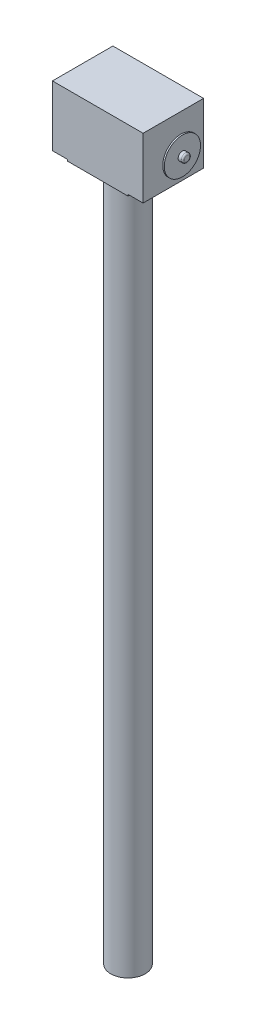
ISO-10303-21;
HEADER;
FILE_DESCRIPTION(('STEP AP214'),'2;1');
FILE_NAME('part.step','',(''),(''),'','','');
FILE_SCHEMA(('AUTOMOTIVE_DESIGN { 1 0 10303 214 1 1 1 1 }'));
ENDSEC;
DATA;
#1=APPLICATION_CONTEXT('core data for automotive mechanical design processes');
#2=APPLICATION_PROTOCOL_DEFINITION('international standard','automotive_design',2000,#1);
#3=PRODUCT_CONTEXT('',#1,'mechanical');
#4=PRODUCT('Part','Part','',(#3));
#5=PRODUCT_RELATED_PRODUCT_CATEGORY('part','',(#4));
#6=PRODUCT_DEFINITION_FORMATION('','',#4);
#7=PRODUCT_DEFINITION_CONTEXT('part definition',#1,'design');
#8=PRODUCT_DEFINITION('design','',#6,#7);
#9=PRODUCT_DEFINITION_SHAPE('','',#8);
#10=(LENGTH_UNIT() NAMED_UNIT(*) SI_UNIT(.MILLI.,.METRE.));
#11=(NAMED_UNIT(*) PLANE_ANGLE_UNIT() SI_UNIT($,.RADIAN.));
#12=(NAMED_UNIT(*) SI_UNIT($,.STERADIAN.) SOLID_ANGLE_UNIT());
#13=UNCERTAINTY_MEASURE_WITH_UNIT(LENGTH_MEASURE(1.E-05),#10,'distance_accuracy_value','');
#14=(GEOMETRIC_REPRESENTATION_CONTEXT(3) GLOBAL_UNCERTAINTY_ASSIGNED_CONTEXT((#13)) GLOBAL_UNIT_ASSIGNED_CONTEXT((#10,
#11,#12)) REPRESENTATION_CONTEXT('',''));
#15=CARTESIAN_POINT('',(0.,0.,0.));
#16=DIRECTION('',(0.,0.,1.));
#17=DIRECTION('',(1.,0.,0.));
#18=AXIS2_PLACEMENT_3D('',#15,#16,#17);
#19=CARTESIAN_POINT('',(0.,-5.,0.));
#20=DIRECTION('',(0.,-1.,0.));
#21=DIRECTION('',(0.,0.,-1.));
#22=AXIS2_PLACEMENT_3D('',#19,#20,#21);
#23=PLANE('',#22);
#24=DIRECTION('',(0.,0.,-1.));
#25=VECTOR('',#24,1.);
#26=CARTESIAN_POINT('',(-100.,-5.,100.));
#27=LINE('',#26,#25);
#28=CARTESIAN_POINT('',(-100.,-5.,100.));
#29=VERTEX_POINT('',#28);
#30=CARTESIAN_POINT('',(-100.,-5.,-100.));
#31=VERTEX_POINT('',#30);
#32=EDGE_CURVE('E110',#29,#31,#27,.T.);
#33=ORIENTED_EDGE('',*,*,#32,.T.);
#34=DIRECTION('',(1.,0.,0.));
#35=VECTOR('',#34,1.);
#36=CARTESIAN_POINT('',(-100.,-5.,-100.));
#37=LINE('',#36,#35);
#38=CARTESIAN_POINT('',(100.,-5.,-100.));
#39=VERTEX_POINT('',#38);
#40=EDGE_CURVE('E99',#31,#39,#37,.T.);
#41=ORIENTED_EDGE('',*,*,#40,.T.);
#42=DIRECTION('',(0.,0.,1.));
#43=VECTOR('',#42,1.);
#44=CARTESIAN_POINT('',(100.,-5.,100.));
#45=LINE('',#44,#43);
#46=CARTESIAN_POINT('',(100.,-5.,100.));
#47=VERTEX_POINT('',#46);
#48=EDGE_CURVE('E109',#39,#47,#45,.T.);
#49=ORIENTED_EDGE('',*,*,#48,.T.);
#50=DIRECTION('',(-1.,0.,0.));
#51=VECTOR('',#50,1.);
#52=CARTESIAN_POINT('',(-100.,-5.,100.));
#53=LINE('',#52,#51);
#54=EDGE_CURVE('E115',#47,#29,#53,.T.);
#55=ORIENTED_EDGE('',*,*,#54,.T.);
#56=EDGE_LOOP('',(#33,#41,#49,#55));
#57=FACE_BOUND('',#56,.T.);
#58=CARTESIAN_POINT('',(0.,-5.,0.));
#59=DIRECTION('',(0.,-1.,0.));
#60=DIRECTION('',(0.,0.,-1.));
#61=AXIS2_PLACEMENT_3D('',#58,#59,#60);
#62=CIRCLE('',#61,57.);
#63=CARTESIAN_POINT('',(0.,-5.,-57.));
#64=VERTEX_POINT('',#63);
#65=EDGE_CURVE('E156',#64,#64,#62,.T.);
#66=ORIENTED_EDGE('',*,*,#65,.F.);
#67=EDGE_LOOP('',(#66));
#68=FACE_BOUND('',#67,.T.);
#69=ADVANCED_FACE('F34',(#57,#68),#23,.T.);
#70=CARTESIAN_POINT('',(0.,0.,0.));
#71=DIRECTION('',(0.,1.,0.));
#72=DIRECTION('',(0.,0.,1.));
#73=AXIS2_PLACEMENT_3D('',#70,#71,#72);
#74=PLANE('',#73);
#75=DIRECTION('',(0.,0.,-1.));
#76=VECTOR('',#75,1.);
#77=CARTESIAN_POINT('',(-100.,0.,100.));
#78=LINE('',#77,#76);
#79=CARTESIAN_POINT('',(-100.,0.,100.));
#80=VERTEX_POINT('',#79);
#81=CARTESIAN_POINT('',(-100.,0.,-100.));
#82=VERTEX_POINT('',#81);
#83=EDGE_CURVE('E51',#80,#82,#78,.T.);
#84=ORIENTED_EDGE('',*,*,#83,.F.);
#85=DIRECTION('',(1.,0.,0.));
#86=VECTOR('',#85,1.);
#87=CARTESIAN_POINT('',(-150.,0.,100.));
#88=LINE('',#87,#86);
#89=CARTESIAN_POINT('',(-150.,0.,100.));
#90=VERTEX_POINT('',#89);
#91=EDGE_CURVE('E237',#90,#80,#88,.T.);
#92=ORIENTED_EDGE('',*,*,#91,.F.);
#93=DIRECTION('',(0.,0.,1.));
#94=VECTOR('',#93,1.);
#95=CARTESIAN_POINT('',(-150.,0.,-100.));
#96=LINE('',#95,#94);
#97=CARTESIAN_POINT('',(-150.,0.,-100.));
#98=VERTEX_POINT('',#97);
#99=EDGE_CURVE('E229',#98,#90,#96,.T.);
#100=ORIENTED_EDGE('',*,*,#99,.F.);
#101=DIRECTION('',(-1.,0.,0.));
#102=VECTOR('',#101,1.);
#103=CARTESIAN_POINT('',(-150.,0.,-100.));
#104=LINE('',#103,#102);
#105=EDGE_CURVE('E56',#82,#98,#104,.T.);
#106=ORIENTED_EDGE('',*,*,#105,.F.);
#107=EDGE_LOOP('',(#84,#92,#100,#106));
#108=FACE_BOUND('',#107,.T.);
#109=ADVANCED_FACE('F171',(#108),#74,.F.);
#110=DIRECTION('',(0.,0.,1.));
#111=VECTOR('',#110,1.);
#112=CARTESIAN_POINT('',(100.,0.,100.));
#113=LINE('',#112,#111);
#114=CARTESIAN_POINT('',(100.,0.,-100.));
#115=VERTEX_POINT('',#114);
#116=CARTESIAN_POINT('',(100.,0.,100.));
#117=VERTEX_POINT('',#116);
#118=EDGE_CURVE('E119',#115,#117,#113,.T.);
#119=ORIENTED_EDGE('',*,*,#118,.F.);
#120=CARTESIAN_POINT('',(150.,0.,-100.));
#121=VERTEX_POINT('',#120);
#122=EDGE_CURVE('E251',#121,#115,#104,.T.);
#123=ORIENTED_EDGE('',*,*,#122,.F.);
#124=DIRECTION('',(0.,0.,-1.));
#125=VECTOR('',#124,1.);
#126=CARTESIAN_POINT('',(150.,0.,-100.));
#127=LINE('',#126,#125);
#128=CARTESIAN_POINT('',(150.,0.,100.));
#129=VERTEX_POINT('',#128);
#130=EDGE_CURVE('E246',#129,#121,#127,.T.);
#131=ORIENTED_EDGE('',*,*,#130,.F.);
#132=EDGE_CURVE('E147',#117,#129,#88,.T.);
#133=ORIENTED_EDGE('',*,*,#132,.F.);
#134=EDGE_LOOP('',(#119,#123,#131,#133));
#135=FACE_BOUND('',#134,.T.);
#136=ADVANCED_FACE('F176',(#135),#74,.F.);
#137=CARTESIAN_POINT('',(190.,100.,0.));
#138=DIRECTION('',(1.,0.,0.));
#139=DIRECTION('',(0.,0.,-1.));
#140=AXIS2_PLACEMENT_3D('',#137,#138,#139);
#141=TOROIDAL_SURFACE('',#140,9.,5.);
#142=CARTESIAN_POINT('',(195.,100.,0.));
#143=DIRECTION('',(1.,0.,0.));
#144=DIRECTION('',(0.,0.,-1.));
#145=AXIS2_PLACEMENT_3D('',#142,#143,#144);
#146=CIRCLE('',#145,9.);
#147=CARTESIAN_POINT('',(195.,100.,-9.00000000000002));
#148=VERTEX_POINT('',#147);
#149=EDGE_CURVE('E43',#148,#148,#146,.T.);
#150=ORIENTED_EDGE('',*,*,#149,.F.);
#151=EDGE_LOOP('',(#150));
#152=FACE_BOUND('',#151,.T.);
#153=CARTESIAN_POINT('',(190.,100.,0.));
#154=DIRECTION('',(1.,0.,0.));
#155=DIRECTION('',(0.,0.,-1.));
#156=AXIS2_PLACEMENT_3D('',#153,#154,#155);
#157=CIRCLE('',#156,14.);
#158=CARTESIAN_POINT('',(190.,100.,-14.));
#159=VERTEX_POINT('',#158);
#160=EDGE_CURVE('E11',#159,#159,#157,.F.);
#161=ORIENTED_EDGE('',*,*,#160,.F.);
#162=EDGE_LOOP('',(#161));
#163=FACE_BOUND('',#162,.T.);
#164=ADVANCED_FACE('F36',(#152,#163),#141,.T.);
#165=CARTESIAN_POINT('',(180.,100.,0.));
#166=DIRECTION('',(1.,0.,0.));
#167=DIRECTION('',(0.,0.,-1.));
#168=AXIS2_PLACEMENT_3D('',#165,#166,#167);
#169=PLANE('',#168);
#170=CARTESIAN_POINT('',(180.,100.,0.));
#171=DIRECTION('',(1.,0.,0.));
#172=DIRECTION('',(0.,0.,-1.));
#173=AXIS2_PLACEMENT_3D('',#170,#171,#172);
#174=CIRCLE('',#173,60.);
#175=CARTESIAN_POINT('',(180.,100.,-60.));
#176=VERTEX_POINT('',#175);
#177=EDGE_CURVE('E239',#176,#176,#174,.T.);
#178=ORIENTED_EDGE('',*,*,#177,.T.);
#179=EDGE_LOOP('',(#178));
#180=FACE_BOUND('',#179,.T.);
#181=CARTESIAN_POINT('',(180.,100.,0.));
#182=DIRECTION('',(1.,0.,0.));
#183=DIRECTION('',(0.,0.,-1.));
#184=AXIS2_PLACEMENT_3D('',#181,#182,#183);
#185=CIRCLE('',#184,14.);
#186=CARTESIAN_POINT('',(180.,100.,-14.));
#187=VERTEX_POINT('',#186);
#188=EDGE_CURVE('E122',#187,#187,#185,.T.);
#189=ORIENTED_EDGE('',*,*,#188,.F.);
#190=EDGE_LOOP('',(#189));
#191=FACE_BOUND('',#190,.T.);
#192=ADVANCED_FACE('F194',(#180,#191),#169,.T.);
#193=CARTESIAN_POINT('',(150.,200.,-100.));
#194=DIRECTION('',(-1.,0.,0.));
#195=DIRECTION('',(0.,0.,1.));
#196=AXIS2_PLACEMENT_3D('',#193,#194,#195);
#197=PLANE('',#196);
#198=ORIENTED_EDGE('',*,*,#130,.T.);
#199=DIRECTION('',(0.,-1.,0.));
#200=VECTOR('',#199,1.);
#201=CARTESIAN_POINT('',(150.,200.,-100.));
#202=LINE('',#201,#200);
#203=CARTESIAN_POINT('',(150.,200.,-100.));
#204=VERTEX_POINT('',#203);
#205=EDGE_CURVE('E256',#204,#121,#202,.T.);
#206=ORIENTED_EDGE('',*,*,#205,.F.);
#207=DIRECTION('',(0.,0.,-1.));
#208=VECTOR('',#207,1.);
#209=CARTESIAN_POINT('',(150.,200.,-100.));
#210=LINE('',#209,#208);
#211=CARTESIAN_POINT('',(150.,200.,100.));
#212=VERTEX_POINT('',#211);
#213=EDGE_CURVE('E290',#212,#204,#210,.T.);
#214=ORIENTED_EDGE('',*,*,#213,.F.);
#215=DIRECTION('',(0.,-1.,0.));
#216=VECTOR('',#215,1.);
#217=CARTESIAN_POINT('',(150.,200.,100.));
#218=LINE('',#217,#216);
#219=EDGE_CURVE('E259',#212,#129,#218,.T.);
#220=ORIENTED_EDGE('',*,*,#219,.T.);
#221=EDGE_LOOP('',(#198,#206,#214,#220));
#222=FACE_BOUND('',#221,.T.);
#223=CARTESIAN_POINT('',(150.,100.,0.));
#224=DIRECTION('',(-1.,0.,0.));
#225=DIRECTION('',(0.,0.,1.));
#226=AXIS2_PLACEMENT_3D('',#223,#224,#225);
#227=CIRCLE('',#226,14.);
#228=CARTESIAN_POINT('',(150.,100.,14.));
#229=VERTEX_POINT('',#228);
#230=EDGE_CURVE('E263',#229,#229,#227,.F.);
#231=ORIENTED_EDGE('',*,*,#230,.F.);
#232=EDGE_LOOP('',(#231));
#233=FACE_BOUND('',#232,.T.);
#234=ADVANCED_FACE('F197',(#222,#233),#197,.F.);
#235=CARTESIAN_POINT('',(-150.,200.,-100.));
#236=DIRECTION('',(1.,0.,0.));
#237=DIRECTION('',(0.,0.,-1.));
#238=AXIS2_PLACEMENT_3D('',#235,#236,#237);
#239=PLANE('',#238);
#240=ORIENTED_EDGE('',*,*,#99,.T.);
#241=DIRECTION('',(0.,-1.,0.));
#242=VECTOR('',#241,1.);
#243=CARTESIAN_POINT('',(-150.,200.,100.));
#244=LINE('',#243,#242);
#245=CARTESIAN_POINT('',(-150.,200.,100.));
#246=VERTEX_POINT('',#245);
#247=EDGE_CURVE('E232',#246,#90,#244,.T.);
#248=ORIENTED_EDGE('',*,*,#247,.F.);
#249=DIRECTION('',(0.,0.,1.));
#250=VECTOR('',#249,1.);
#251=CARTESIAN_POINT('',(-150.,200.,-100.));
#252=LINE('',#251,#250);
#253=CARTESIAN_POINT('',(-150.,200.,-100.));
#254=VERTEX_POINT('',#253);
#255=EDGE_CURVE('E285',#254,#246,#252,.T.);
#256=ORIENTED_EDGE('',*,*,#255,.F.);
#257=DIRECTION('',(0.,-1.,0.));
#258=VECTOR('',#257,1.);
#259=CARTESIAN_POINT('',(-150.,200.,-100.));
#260=LINE('',#259,#258);
#261=EDGE_CURVE('E234',#254,#98,#260,.T.);
#262=ORIENTED_EDGE('',*,*,#261,.T.);
#263=EDGE_LOOP('',(#240,#248,#256,#262));
#264=FACE_BOUND('',#263,.T.);
#265=ADVANCED_FACE('F219',(#264),#239,.F.);
#266=CARTESIAN_POINT('',(-150.,200.,100.));
#267=DIRECTION('',(0.,0.,-1.));
#268=DIRECTION('',(-1.,0.,0.));
#269=AXIS2_PLACEMENT_3D('',#266,#267,#268);
#270=PLANE('',#269);
#271=ORIENTED_EDGE('',*,*,#91,.T.);
#272=DIRECTION('',(0.,1.,0.));
#273=VECTOR('',#272,1.);
#274=CARTESIAN_POINT('',(-100.,-5.,100.));
#275=LINE('',#274,#273);
#276=EDGE_CURVE('E136',#29,#80,#275,.T.);
#277=ORIENTED_EDGE('',*,*,#276,.F.);
#278=ORIENTED_EDGE('',*,*,#54,.F.);
#279=DIRECTION('',(0.,1.,0.));
#280=VECTOR('',#279,1.);
#281=CARTESIAN_POINT('',(100.,-5.,100.));
#282=LINE('',#281,#280);
#283=EDGE_CURVE('E127',#47,#117,#282,.T.);
#284=ORIENTED_EDGE('',*,*,#283,.T.);
#285=ORIENTED_EDGE('',*,*,#132,.T.);
#286=ORIENTED_EDGE('',*,*,#219,.F.);
#287=DIRECTION('',(1.,0.,0.));
#288=VECTOR('',#287,1.);
#289=CARTESIAN_POINT('',(-150.,200.,100.));
#290=LINE('',#289,#288);
#291=EDGE_CURVE('E287',#246,#212,#290,.T.);
#292=ORIENTED_EDGE('',*,*,#291,.F.);
#293=ORIENTED_EDGE('',*,*,#247,.T.);
#294=EDGE_LOOP('',(#271,#277,#278,#284,#285,#286,#292,#293));
#295=FACE_BOUND('',#294,.T.);
#296=ADVANCED_FACE('F216',(#295),#270,.F.);
#297=CARTESIAN_POINT('',(-150.,200.,-100.));
#298=DIRECTION('',(0.,0.,1.));
#299=DIRECTION('',(1.,0.,0.));
#300=AXIS2_PLACEMENT_3D('',#297,#298,#299);
#301=PLANE('',#300);
#302=ORIENTED_EDGE('',*,*,#122,.T.);
#303=DIRECTION('',(0.,1.,0.));
#304=VECTOR('',#303,1.);
#305=CARTESIAN_POINT('',(100.,-5.,-100.));
#306=LINE('',#305,#304);
#307=EDGE_CURVE('E106',#39,#115,#306,.T.);
#308=ORIENTED_EDGE('',*,*,#307,.F.);
#309=ORIENTED_EDGE('',*,*,#40,.F.);
#310=DIRECTION('',(0.,1.,0.));
#311=VECTOR('',#310,1.);
#312=CARTESIAN_POINT('',(-100.,-5.,-100.));
#313=LINE('',#312,#311);
#314=EDGE_CURVE('E104',#31,#82,#313,.T.);
#315=ORIENTED_EDGE('',*,*,#314,.T.);
#316=ORIENTED_EDGE('',*,*,#105,.T.);
#317=ORIENTED_EDGE('',*,*,#261,.F.);
#318=DIRECTION('',(-1.,0.,0.));
#319=VECTOR('',#318,1.);
#320=CARTESIAN_POINT('',(-150.,200.,-100.));
#321=LINE('',#320,#319);
#322=EDGE_CURVE('E242',#204,#254,#321,.T.);
#323=ORIENTED_EDGE('',*,*,#322,.F.);
#324=ORIENTED_EDGE('',*,*,#205,.T.);
#325=EDGE_LOOP('',(#302,#308,#309,#315,#316,#317,#323,#324));
#326=FACE_BOUND('',#325,.T.);
#327=ADVANCED_FACE('F102',(#326),#301,.F.);
#328=CARTESIAN_POINT('',(0.,200.,0.));
#329=DIRECTION('',(0.,1.,0.));
#330=DIRECTION('',(0.,0.,1.));
#331=AXIS2_PLACEMENT_3D('',#328,#329,#330);
#332=PLANE('',#331);
#333=ORIENTED_EDGE('',*,*,#255,.T.);
#334=ORIENTED_EDGE('',*,*,#291,.T.);
#335=ORIENTED_EDGE('',*,*,#213,.T.);
#336=ORIENTED_EDGE('',*,*,#322,.T.);
#337=EDGE_LOOP('',(#333,#334,#335,#336));
#338=FACE_BOUND('',#337,.T.);
#339=ADVANCED_FACE('F209',(#338),#332,.T.);
#340=CARTESIAN_POINT('',(175.,100.,0.));
#341=DIRECTION('',(-1.,0.,0.));
#342=DIRECTION('',(0.,0.,1.));
#343=AXIS2_PLACEMENT_3D('',#340,#341,#342);
#344=CYLINDRICAL_SURFACE('',#343,14.);
#345=CARTESIAN_POINT('',(175.,100.,0.));
#346=DIRECTION('',(1.,0.,0.));
#347=DIRECTION('',(0.,0.,-1.));
#348=AXIS2_PLACEMENT_3D('',#345,#346,#347);
#349=CIRCLE('',#348,14.);
#350=CARTESIAN_POINT('',(175.,100.,-14.));
#351=VERTEX_POINT('',#350);
#352=EDGE_CURVE('E235',#351,#351,#349,.T.);
#353=ORIENTED_EDGE('',*,*,#352,.F.);
#354=EDGE_LOOP('',(#353));
#355=FACE_BOUND('',#354,.T.);
#356=ORIENTED_EDGE('',*,*,#230,.T.);
#357=EDGE_LOOP('',(#356));
#358=FACE_BOUND('',#357,.T.);
#359=ADVANCED_FACE('F202',(#355,#358),#344,.T.);
#360=CARTESIAN_POINT('',(175.,100.,0.));
#361=DIRECTION('',(1.,0.,0.));
#362=DIRECTION('',(0.,0.,-1.));
#363=AXIS2_PLACEMENT_3D('',#360,#361,#362);
#364=PLANE('',#363);
#365=CARTESIAN_POINT('',(175.,100.,0.));
#366=DIRECTION('',(1.,0.,0.));
#367=DIRECTION('',(0.,0.,-1.));
#368=AXIS2_PLACEMENT_3D('',#365,#366,#367);
#369=CIRCLE('',#368,60.);
#370=CARTESIAN_POINT('',(175.,100.,-60.));
#371=VERTEX_POINT('',#370);
#372=EDGE_CURVE('E125',#371,#371,#369,.T.);
#373=ORIENTED_EDGE('',*,*,#372,.F.);
#374=EDGE_LOOP('',(#373));
#375=FACE_BOUND('',#374,.T.);
#376=ORIENTED_EDGE('',*,*,#352,.T.);
#377=EDGE_LOOP('',(#376));
#378=FACE_BOUND('',#377,.T.);
#379=ADVANCED_FACE('F199',(#375,#378),#364,.F.);
#380=CARTESIAN_POINT('',(180.,100.,0.));
#381=DIRECTION('',(-1.,0.,0.));
#382=DIRECTION('',(0.,0.,1.));
#383=AXIS2_PLACEMENT_3D('',#380,#381,#382);
#384=CYLINDRICAL_SURFACE('',#383,60.);
#385=ORIENTED_EDGE('',*,*,#177,.F.);
#386=EDGE_LOOP('',(#385));
#387=FACE_BOUND('',#386,.T.);
#388=ORIENTED_EDGE('',*,*,#372,.T.);
#389=EDGE_LOOP('',(#388));
#390=FACE_BOUND('',#389,.T.);
#391=ADVANCED_FACE('F192',(#387,#390),#384,.T.);
#392=CARTESIAN_POINT('',(195.,100.,0.));
#393=DIRECTION('',(-1.,0.,0.));
#394=DIRECTION('',(0.,0.,1.));
#395=AXIS2_PLACEMENT_3D('',#392,#393,#394);
#396=CYLINDRICAL_SURFACE('',#395,14.);
#397=ORIENTED_EDGE('',*,*,#160,.T.);
#398=EDGE_LOOP('',(#397));
#399=FACE_BOUND('',#398,.T.);
#400=ORIENTED_EDGE('',*,*,#188,.T.);
#401=EDGE_LOOP('',(#400));
#402=FACE_BOUND('',#401,.T.);
#403=ADVANCED_FACE('F188',(#399,#402),#396,.T.);
#404=CARTESIAN_POINT('',(195.,100.,0.));
#405=DIRECTION('',(1.,0.,0.));
#406=DIRECTION('',(0.,0.,-1.));
#407=AXIS2_PLACEMENT_3D('',#404,#405,#406);
#408=PLANE('',#407);
#409=ORIENTED_EDGE('',*,*,#149,.T.);
#410=EDGE_LOOP('',(#409));
#411=FACE_BOUND('',#410,.T.);
#412=ADVANCED_FACE('F185',(#411),#408,.T.);
#413=CARTESIAN_POINT('',(-100.,-5.,100.));
#414=DIRECTION('',(1.,0.,0.));
#415=DIRECTION('',(0.,0.,-1.));
#416=AXIS2_PLACEMENT_3D('',#413,#414,#415);
#417=PLANE('',#416);
#418=ORIENTED_EDGE('',*,*,#83,.T.);
#419=ORIENTED_EDGE('',*,*,#314,.F.);
#420=ORIENTED_EDGE('',*,*,#32,.F.);
#421=ORIENTED_EDGE('',*,*,#276,.T.);
#422=EDGE_LOOP('',(#418,#419,#420,#421));
#423=FACE_BOUND('',#422,.T.);
#424=ADVANCED_FACE('F121',(#423),#417,.F.);
#425=CARTESIAN_POINT('',(100.,-5.,100.));
#426=DIRECTION('',(-1.,0.,0.));
#427=DIRECTION('',(0.,0.,1.));
#428=AXIS2_PLACEMENT_3D('',#425,#426,#427);
#429=PLANE('',#428);
#430=ORIENTED_EDGE('',*,*,#118,.T.);
#431=ORIENTED_EDGE('',*,*,#283,.F.);
#432=ORIENTED_EDGE('',*,*,#48,.F.);
#433=ORIENTED_EDGE('',*,*,#307,.T.);
#434=EDGE_LOOP('',(#430,#431,#432,#433));
#435=FACE_BOUND('',#434,.T.);
#436=ADVANCED_FACE('F167',(#435),#429,.F.);
#437=CARTESIAN_POINT('',(0.,-2305.,0.));
#438=DIRECTION('',(0.,1.,0.));
#439=DIRECTION('',(0.,0.,1.));
#440=AXIS2_PLACEMENT_3D('',#437,#438,#439);
#441=CYLINDRICAL_SURFACE('',#440,57.);
#442=CARTESIAN_POINT('',(0.,-2305.,0.));
#443=DIRECTION('',(0.,-1.,0.));
#444=DIRECTION('',(0.,0.,-1.));
#445=AXIS2_PLACEMENT_3D('',#442,#443,#444);
#446=CIRCLE('',#445,57.);
#447=CARTESIAN_POINT('',(0.,-2305.,-57.));
#448=VERTEX_POINT('',#447);
#449=EDGE_CURVE('E135',#448,#448,#446,.T.);
#450=ORIENTED_EDGE('',*,*,#449,.F.);
#451=EDGE_LOOP('',(#450));
#452=FACE_BOUND('',#451,.T.);
#453=ORIENTED_EDGE('',*,*,#65,.T.);
#454=EDGE_LOOP('',(#453));
#455=FACE_BOUND('',#454,.T.);
#456=ADVANCED_FACE('F164',(#452,#455),#441,.T.);
#457=CARTESIAN_POINT('',(0.,-2305.,0.));
#458=DIRECTION('',(0.,-1.,0.));
#459=DIRECTION('',(0.,0.,-1.));
#460=AXIS2_PLACEMENT_3D('',#457,#458,#459);
#461=PLANE('',#460);
#462=ORIENTED_EDGE('',*,*,#449,.T.);
#463=EDGE_LOOP('',(#462));
#464=FACE_BOUND('',#463,.T.);
#465=ADVANCED_FACE('F162',(#464),#461,.T.);
#466=CLOSED_SHELL('',(#69,#109,#136,#164,#192,#234,#265,#296,#327,#339,#359,#379,#391,#403,#412,
#424,#436,#456,#465));
#467=MANIFOLD_SOLID_BREP('B2',#466);
#468=ADVANCED_BREP_SHAPE_REPRESENTATION('',(#18,#467),#14);
#469=SHAPE_DEFINITION_REPRESENTATION(#9,#468);
ENDSEC;
END-ISO-10303-21;
